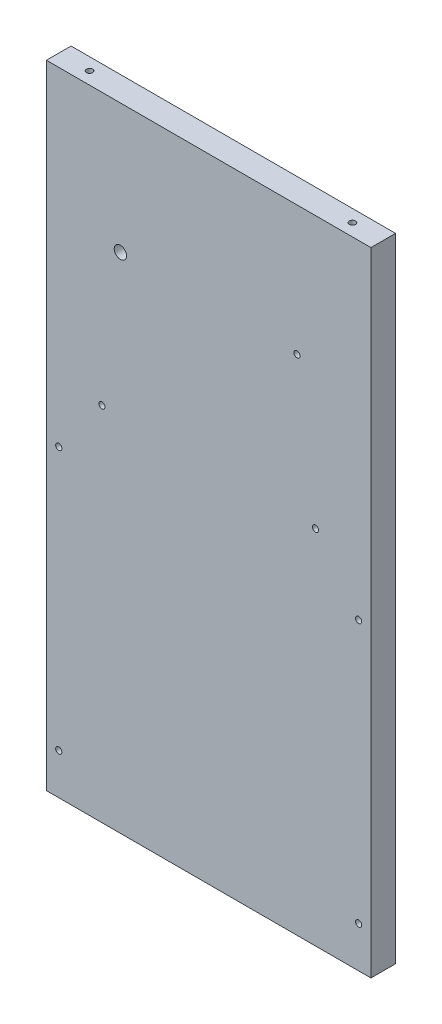
ISO-10303-21;
HEADER;
FILE_DESCRIPTION(('STEP AP214'),'2;1');
FILE_NAME('part.step','',(''),(''),'','','');
FILE_SCHEMA(('AUTOMOTIVE_DESIGN { 1 0 10303 214 1 1 1 1 }'));
ENDSEC;
DATA;
#1=APPLICATION_CONTEXT('core data for automotive mechanical design processes');
#2=APPLICATION_PROTOCOL_DEFINITION('international standard','automotive_design',2000,#1);
#3=PRODUCT_CONTEXT('',#1,'mechanical');
#4=PRODUCT('Part','Part','',(#3));
#5=PRODUCT_RELATED_PRODUCT_CATEGORY('part','',(#4));
#6=PRODUCT_DEFINITION_FORMATION('','',#4);
#7=PRODUCT_DEFINITION_CONTEXT('part definition',#1,'design');
#8=PRODUCT_DEFINITION('design','',#6,#7);
#9=PRODUCT_DEFINITION_SHAPE('','',#8);
#10=(LENGTH_UNIT() NAMED_UNIT(*) SI_UNIT(.MILLI.,.METRE.));
#11=(NAMED_UNIT(*) PLANE_ANGLE_UNIT() SI_UNIT($,.RADIAN.));
#12=(NAMED_UNIT(*) SI_UNIT($,.STERADIAN.) SOLID_ANGLE_UNIT());
#13=UNCERTAINTY_MEASURE_WITH_UNIT(LENGTH_MEASURE(1.E-05),#10,'distance_accuracy_value','');
#14=(GEOMETRIC_REPRESENTATION_CONTEXT(3) GLOBAL_UNCERTAINTY_ASSIGNED_CONTEXT((#13)) GLOBAL_UNIT_ASSIGNED_CONTEXT((#10,
#11,#12)) REPRESENTATION_CONTEXT('',''));
#15=CARTESIAN_POINT('',(0.,0.,0.));
#16=DIRECTION('',(0.,0.,1.));
#17=DIRECTION('',(1.,0.,0.));
#18=AXIS2_PLACEMENT_3D('',#15,#16,#17);
#19=CARTESIAN_POINT('',(-129.951219512195,-28.4634146341464,12.));
#20=DIRECTION('',(0.,0.,-1.));
#21=DIRECTION('',(-1.,0.,0.));
#22=AXIS2_PLACEMENT_3D('',#19,#20,#21);
#23=CYLINDRICAL_SURFACE('',#22,1.5);
#24=CARTESIAN_POINT('',(-129.951219512195,-28.4634146341464,12.));
#25=DIRECTION('',(0.,0.,1.));
#26=DIRECTION('',(1.,0.,0.));
#27=AXIS2_PLACEMENT_3D('',#24,#25,#26);
#28=CIRCLE('',#27,1.5);
#29=CARTESIAN_POINT('',(-128.451219512195,-28.4634146341464,12.));
#30=VERTEX_POINT('',#29);
#31=EDGE_CURVE('E104',#30,#30,#28,.T.);
#32=ORIENTED_EDGE('',*,*,#31,.T.);
#33=EDGE_LOOP('',(#32));
#34=FACE_BOUND('',#33,.T.);
#35=CARTESIAN_POINT('',(-129.951219512195,-28.4634146341464,1.49999999999999));
#36=DIRECTION('',(0.,0.,-1.));
#37=DIRECTION('',(-1.,0.,0.));
#38=AXIS2_PLACEMENT_3D('',#35,#36,#37);
#39=CIRCLE('',#38,1.5);
#40=CARTESIAN_POINT('',(-131.451219512195,-28.4634146341464,1.49999999999999));
#41=VERTEX_POINT('',#40);
#42=EDGE_CURVE('E37',#41,#41,#39,.T.);
#43=ORIENTED_EDGE('',*,*,#42,.T.);
#44=EDGE_LOOP('',(#43));
#45=FACE_BOUND('',#44,.T.);
#46=ADVANCED_FACE('F33',(#34,#45),#23,.F.);
#47=CARTESIAN_POINT('',(-34.951219512195,40.5365853658536,12.));
#48=DIRECTION('',(0.,0.,-1.));
#49=DIRECTION('',(-1.,0.,0.));
#50=AXIS2_PLACEMENT_3D('',#47,#48,#49);
#51=CYLINDRICAL_SURFACE('',#50,1.5);
#52=CARTESIAN_POINT('',(-34.951219512195,40.5365853658536,12.));
#53=DIRECTION('',(0.,0.,1.));
#54=DIRECTION('',(1.,0.,0.));
#55=AXIS2_PLACEMENT_3D('',#52,#53,#54);
#56=CIRCLE('',#55,1.5);
#57=CARTESIAN_POINT('',(-33.451219512195,40.5365853658536,12.));
#58=VERTEX_POINT('',#57);
#59=EDGE_CURVE('E159',#58,#58,#56,.T.);
#60=ORIENTED_EDGE('',*,*,#59,.T.);
#61=EDGE_LOOP('',(#60));
#62=FACE_BOUND('',#61,.T.);
#63=CARTESIAN_POINT('',(-34.951219512195,40.5365853658536,1.5));
#64=DIRECTION('',(0.,0.,-1.));
#65=DIRECTION('',(-1.,0.,0.));
#66=AXIS2_PLACEMENT_3D('',#63,#64,#65);
#67=CIRCLE('',#66,1.5);
#68=CARTESIAN_POINT('',(-36.451219512195,40.5365853658536,1.5));
#69=VERTEX_POINT('',#68);
#70=EDGE_CURVE('E127',#69,#69,#67,.T.);
#71=ORIENTED_EDGE('',*,*,#70,.T.);
#72=EDGE_LOOP('',(#71));
#73=FACE_BOUND('',#72,.T.);
#74=ADVANCED_FACE('F187',(#62,#73),#51,.F.);
#75=CARTESIAN_POINT('',(-4.95121951219504,-184.463414634146,12.));
#76=DIRECTION('',(0.,0.,-1.));
#77=DIRECTION('',(-1.,0.,0.));
#78=AXIS2_PLACEMENT_3D('',#75,#76,#77);
#79=CYLINDRICAL_SURFACE('',#78,1.5);
#80=CARTESIAN_POINT('',(-4.95121951219504,-184.463414634146,12.));
#81=DIRECTION('',(0.,0.,1.));
#82=DIRECTION('',(1.,0.,0.));
#83=AXIS2_PLACEMENT_3D('',#80,#81,#82);
#84=CIRCLE('',#83,1.5);
#85=CARTESIAN_POINT('',(-3.45121951219504,-184.463414634146,12.));
#86=VERTEX_POINT('',#85);
#87=EDGE_CURVE('E156',#86,#86,#84,.T.);
#88=ORIENTED_EDGE('',*,*,#87,.T.);
#89=EDGE_LOOP('',(#88));
#90=FACE_BOUND('',#89,.T.);
#91=CARTESIAN_POINT('',(-4.95121951219504,-184.463414634146,1.49999999999999));
#92=DIRECTION('',(0.,0.,-1.));
#93=DIRECTION('',(-1.,0.,0.));
#94=AXIS2_PLACEMENT_3D('',#91,#92,#93);
#95=CIRCLE('',#94,1.5);
#96=CARTESIAN_POINT('',(-6.45121951219504,-184.463414634146,1.49999999999999));
#97=VERTEX_POINT('',#96);
#98=EDGE_CURVE('E125',#97,#97,#95,.T.);
#99=ORIENTED_EDGE('',*,*,#98,.T.);
#100=EDGE_LOOP('',(#99));
#101=FACE_BOUND('',#100,.T.);
#102=ADVANCED_FACE('F191',(#90,#101),#79,.F.);
#103=CARTESIAN_POINT('',(-4.95121951219506,-56.4634146341464,12.));
#104=DIRECTION('',(0.,0.,-1.));
#105=DIRECTION('',(-1.,0.,0.));
#106=AXIS2_PLACEMENT_3D('',#103,#104,#105);
#107=CYLINDRICAL_SURFACE('',#106,1.5);
#108=CARTESIAN_POINT('',(-4.95121951219506,-56.4634146341464,12.));
#109=DIRECTION('',(0.,0.,1.));
#110=DIRECTION('',(1.,0.,0.));
#111=AXIS2_PLACEMENT_3D('',#108,#109,#110);
#112=CIRCLE('',#111,1.5);
#113=CARTESIAN_POINT('',(-3.45121951219505,-56.4634146341464,12.));
#114=VERTEX_POINT('',#113);
#115=EDGE_CURVE('E153',#114,#114,#112,.T.);
#116=ORIENTED_EDGE('',*,*,#115,.T.);
#117=EDGE_LOOP('',(#116));
#118=FACE_BOUND('',#117,.T.);
#119=CARTESIAN_POINT('',(-4.95121951219506,-56.4634146341464,1.5));
#120=DIRECTION('',(0.,0.,-1.));
#121=DIRECTION('',(-1.,0.,0.));
#122=AXIS2_PLACEMENT_3D('',#119,#120,#121);
#123=CIRCLE('',#122,1.5);
#124=CARTESIAN_POINT('',(-6.45121951219506,-56.4634146341464,1.5));
#125=VERTEX_POINT('',#124);
#126=EDGE_CURVE('E122',#125,#125,#123,.T.);
#127=ORIENTED_EDGE('',*,*,#126,.T.);
#128=EDGE_LOOP('',(#127));
#129=FACE_BOUND('',#128,.T.);
#130=ADVANCED_FACE('F197',(#118,#129),#107,.F.);
#131=CARTESIAN_POINT('',(-150.951219512195,-184.463414634146,12.));
#132=DIRECTION('',(0.,0.,-1.));
#133=DIRECTION('',(-1.,0.,0.));
#134=AXIS2_PLACEMENT_3D('',#131,#132,#133);
#135=CYLINDRICAL_SURFACE('',#134,1.5);
#136=CARTESIAN_POINT('',(-150.951219512195,-184.463414634146,12.));
#137=DIRECTION('',(0.,0.,1.));
#138=DIRECTION('',(1.,0.,0.));
#139=AXIS2_PLACEMENT_3D('',#136,#137,#138);
#140=CIRCLE('',#139,1.5);
#141=CARTESIAN_POINT('',(-149.451219512195,-184.463414634146,12.));
#142=VERTEX_POINT('',#141);
#143=EDGE_CURVE('E150',#142,#142,#140,.T.);
#144=ORIENTED_EDGE('',*,*,#143,.T.);
#145=EDGE_LOOP('',(#144));
#146=FACE_BOUND('',#145,.T.);
#147=CARTESIAN_POINT('',(-150.951219512195,-184.463414634146,1.49999999999999));
#148=DIRECTION('',(0.,0.,-1.));
#149=DIRECTION('',(-1.,0.,0.));
#150=AXIS2_PLACEMENT_3D('',#147,#148,#149);
#151=CIRCLE('',#150,1.5);
#152=CARTESIAN_POINT('',(-152.451219512195,-184.463414634146,1.49999999999999));
#153=VERTEX_POINT('',#152);
#154=EDGE_CURVE('E118',#153,#153,#151,.T.);
#155=ORIENTED_EDGE('',*,*,#154,.T.);
#156=EDGE_LOOP('',(#155));
#157=FACE_BOUND('',#156,.T.);
#158=ADVANCED_FACE('F201',(#146,#157),#135,.F.);
#159=CARTESIAN_POINT('',(-150.951219512195,-56.4634146341464,12.));
#160=DIRECTION('',(0.,0.,-1.));
#161=DIRECTION('',(-1.,0.,0.));
#162=AXIS2_PLACEMENT_3D('',#159,#160,#161);
#163=CYLINDRICAL_SURFACE('',#162,1.5);
#164=CARTESIAN_POINT('',(-150.951219512195,-56.4634146341464,12.));
#165=DIRECTION('',(0.,0.,1.));
#166=DIRECTION('',(1.,0.,0.));
#167=AXIS2_PLACEMENT_3D('',#164,#165,#166);
#168=CIRCLE('',#167,1.5);
#169=CARTESIAN_POINT('',(-149.451219512195,-56.4634146341464,12.));
#170=VERTEX_POINT('',#169);
#171=EDGE_CURVE('E145',#170,#170,#168,.T.);
#172=ORIENTED_EDGE('',*,*,#171,.T.);
#173=EDGE_LOOP('',(#172));
#174=FACE_BOUND('',#173,.T.);
#175=CARTESIAN_POINT('',(-150.951219512195,-56.4634146341464,1.49999999999999));
#176=DIRECTION('',(0.,0.,-1.));
#177=DIRECTION('',(-1.,0.,0.));
#178=AXIS2_PLACEMENT_3D('',#175,#176,#177);
#179=CIRCLE('',#178,1.5);
#180=CARTESIAN_POINT('',(-152.451219512195,-56.4634146341464,1.49999999999999));
#181=VERTEX_POINT('',#180);
#182=EDGE_CURVE('E115',#181,#181,#179,.T.);
#183=ORIENTED_EDGE('',*,*,#182,.T.);
#184=EDGE_LOOP('',(#183));
#185=FACE_BOUND('',#184,.T.);
#186=ADVANCED_FACE('F180',(#174,#185),#163,.F.);
#187=CARTESIAN_POINT('',(-25.9512195121951,-28.4634146341464,12.));
#188=DIRECTION('',(0.,0.,-1.));
#189=DIRECTION('',(-1.,0.,0.));
#190=AXIS2_PLACEMENT_3D('',#187,#188,#189);
#191=CYLINDRICAL_SURFACE('',#190,1.5);
#192=CARTESIAN_POINT('',(-25.9512195121951,-28.4634146341464,12.));
#193=DIRECTION('',(0.,0.,1.));
#194=DIRECTION('',(1.,0.,0.));
#195=AXIS2_PLACEMENT_3D('',#192,#193,#194);
#196=CIRCLE('',#195,1.5);
#197=CARTESIAN_POINT('',(-24.4512195121951,-28.4634146341464,12.));
#198=VERTEX_POINT('',#197);
#199=EDGE_CURVE('E162',#198,#198,#196,.T.);
#200=ORIENTED_EDGE('',*,*,#199,.T.);
#201=EDGE_LOOP('',(#200));
#202=FACE_BOUND('',#201,.T.);
#203=CARTESIAN_POINT('',(-25.9512195121951,-28.4634146341464,1.5));
#204=DIRECTION('',(0.,0.,-1.));
#205=DIRECTION('',(-1.,0.,0.));
#206=AXIS2_PLACEMENT_3D('',#203,#204,#205);
#207=CIRCLE('',#206,1.5);
#208=CARTESIAN_POINT('',(-27.4512195121951,-28.4634146341464,1.5));
#209=VERTEX_POINT('',#208);
#210=EDGE_CURVE('E110',#209,#209,#207,.T.);
#211=ORIENTED_EDGE('',*,*,#210,.T.);
#212=EDGE_LOOP('',(#211));
#213=FACE_BOUND('',#212,.T.);
#214=ADVANCED_FACE('F171',(#202,#213),#191,.F.);
#215=CARTESIAN_POINT('',(0.,0.,12.));
#216=DIRECTION('',(0.,0.,1.));
#217=DIRECTION('',(1.,0.,0.));
#218=AXIS2_PLACEMENT_3D('',#215,#216,#217);
#219=PLANE('',#218);
#220=ORIENTED_EDGE('',*,*,#171,.F.);
#221=EDGE_LOOP('',(#220));
#222=FACE_BOUND('',#221,.T.);
#223=ORIENTED_EDGE('',*,*,#115,.F.);
#224=EDGE_LOOP('',(#223));
#225=FACE_BOUND('',#224,.T.);
#226=ORIENTED_EDGE('',*,*,#59,.F.);
#227=EDGE_LOOP('',(#226));
#228=FACE_BOUND('',#227,.T.);
#229=ORIENTED_EDGE('',*,*,#31,.F.);
#230=EDGE_LOOP('',(#229));
#231=FACE_BOUND('',#230,.T.);
#232=DIRECTION('',(0.,-1.,0.));
#233=VECTOR('',#232,1.);
#234=CARTESIAN_POINT('',(-156.951219512195,103.536585365854,12.));
#235=LINE('',#234,#233);
#236=CARTESIAN_POINT('',(-156.951219512195,103.536585365854,12.));
#237=VERTEX_POINT('',#236);
#238=CARTESIAN_POINT('',(-156.951219512195,-204.463414634146,12.));
#239=VERTEX_POINT('',#238);
#240=EDGE_CURVE('E88',#237,#239,#235,.T.);
#241=ORIENTED_EDGE('',*,*,#240,.T.);
#242=DIRECTION('',(1.,0.,0.));
#243=VECTOR('',#242,1.);
#244=CARTESIAN_POINT('',(-156.951219512195,-204.463414634146,12.));
#245=LINE('',#244,#243);
#246=CARTESIAN_POINT('',(1.04878048780496,-204.463414634146,12.));
#247=VERTEX_POINT('',#246);
#248=EDGE_CURVE('E82',#239,#247,#245,.T.);
#249=ORIENTED_EDGE('',*,*,#248,.T.);
#250=DIRECTION('',(0.,1.,0.));
#251=VECTOR('',#250,1.);
#252=CARTESIAN_POINT('',(1.04878048780493,103.536585365854,12.));
#253=LINE('',#252,#251);
#254=CARTESIAN_POINT('',(1.04878048780493,103.536585365854,12.));
#255=VERTEX_POINT('',#254);
#256=EDGE_CURVE('E86',#247,#255,#253,.T.);
#257=ORIENTED_EDGE('',*,*,#256,.T.);
#258=DIRECTION('',(-1.,0.,0.));
#259=VECTOR('',#258,1.);
#260=CARTESIAN_POINT('',(-156.951219512195,103.536585365854,12.));
#261=LINE('',#260,#259);
#262=EDGE_CURVE('E52',#255,#237,#261,.T.);
#263=ORIENTED_EDGE('',*,*,#262,.T.);
#264=EDGE_LOOP('',(#241,#249,#257,#263));
#265=FACE_BOUND('',#264,.T.);
#266=ORIENTED_EDGE('',*,*,#199,.F.);
#267=EDGE_LOOP('',(#266));
#268=FACE_BOUND('',#267,.T.);
#269=ORIENTED_EDGE('',*,*,#87,.F.);
#270=EDGE_LOOP('',(#269));
#271=FACE_BOUND('',#270,.T.);
#272=ORIENTED_EDGE('',*,*,#143,.F.);
#273=EDGE_LOOP('',(#272));
#274=FACE_BOUND('',#273,.T.);
#275=CARTESIAN_POINT('',(-120.951219512195,40.5365853658536,12.));
#276=DIRECTION('',(0.,0.,1.));
#277=DIRECTION('',(1.,0.,0.));
#278=AXIS2_PLACEMENT_3D('',#275,#276,#277);
#279=CIRCLE('',#278,2.99999999999999);
#280=CARTESIAN_POINT('',(-117.951219512195,40.5365853658536,12.));
#281=VERTEX_POINT('',#280);
#282=EDGE_CURVE('E142',#281,#281,#279,.T.);
#283=ORIENTED_EDGE('',*,*,#282,.F.);
#284=EDGE_LOOP('',(#283));
#285=FACE_BOUND('',#284,.T.);
#286=ADVANCED_FACE('F83',(#222,#225,#228,#231,#265,#268,#271,#274,#285),#219,.T.);
#287=CARTESIAN_POINT('',(0.,0.,0.));
#288=DIRECTION('',(0.,0.,1.));
#289=DIRECTION('',(1.,0.,0.));
#290=AXIS2_PLACEMENT_3D('',#287,#288,#289);
#291=PLANE('',#290);
#292=CARTESIAN_POINT('',(-150.951219512195,-184.463414634146,0.));
#293=DIRECTION('',(0.,0.,1.));
#294=DIRECTION('',(1.,0.,0.));
#295=AXIS2_PLACEMENT_3D('',#292,#293,#294);
#296=CIRCLE('',#295,2.99999999999999);
#297=CARTESIAN_POINT('',(-147.951219512195,-184.463414634146,0.));
#298=VERTEX_POINT('',#297);
#299=EDGE_CURVE('E272',#298,#298,#296,.T.);
#300=ORIENTED_EDGE('',*,*,#299,.T.);
#301=EDGE_LOOP('',(#300));
#302=FACE_BOUND('',#301,.T.);
#303=CARTESIAN_POINT('',(-150.951219512195,-56.4634146341464,0.));
#304=DIRECTION('',(0.,0.,1.));
#305=DIRECTION('',(1.,0.,0.));
#306=AXIS2_PLACEMENT_3D('',#303,#304,#305);
#307=CIRCLE('',#306,2.99999999999999);
#308=CARTESIAN_POINT('',(-147.951219512195,-56.4634146341464,0.));
#309=VERTEX_POINT('',#308);
#310=EDGE_CURVE('E277',#309,#309,#307,.T.);
#311=ORIENTED_EDGE('',*,*,#310,.T.);
#312=EDGE_LOOP('',(#311));
#313=FACE_BOUND('',#312,.T.);
#314=CARTESIAN_POINT('',(-4.95121951219504,-184.463414634146,0.));
#315=DIRECTION('',(0.,0.,1.));
#316=DIRECTION('',(1.,0.,0.));
#317=AXIS2_PLACEMENT_3D('',#314,#315,#316);
#318=CIRCLE('',#317,3.);
#319=CARTESIAN_POINT('',(-1.95121951219504,-184.463414634146,0.));
#320=VERTEX_POINT('',#319);
#321=EDGE_CURVE('E274',#320,#320,#318,.T.);
#322=ORIENTED_EDGE('',*,*,#321,.T.);
#323=EDGE_LOOP('',(#322));
#324=FACE_BOUND('',#323,.T.);
#325=CARTESIAN_POINT('',(-4.95121951219506,-56.4634146341464,0.));
#326=DIRECTION('',(0.,0.,1.));
#327=DIRECTION('',(1.,0.,0.));
#328=AXIS2_PLACEMENT_3D('',#325,#326,#327);
#329=CIRCLE('',#328,3.);
#330=CARTESIAN_POINT('',(-1.95121951219505,-56.4634146341464,0.));
#331=VERTEX_POINT('',#330);
#332=EDGE_CURVE('E140',#331,#331,#329,.T.);
#333=ORIENTED_EDGE('',*,*,#332,.T.);
#334=EDGE_LOOP('',(#333));
#335=FACE_BOUND('',#334,.T.);
#336=CARTESIAN_POINT('',(-34.951219512195,40.5365853658536,0.));
#337=DIRECTION('',(0.,0.,1.));
#338=DIRECTION('',(1.,0.,0.));
#339=AXIS2_PLACEMENT_3D('',#336,#337,#338);
#340=CIRCLE('',#339,3.);
#341=CARTESIAN_POINT('',(-31.951219512195,40.5365853658536,0.));
#342=VERTEX_POINT('',#341);
#343=EDGE_CURVE('E283',#342,#342,#340,.T.);
#344=ORIENTED_EDGE('',*,*,#343,.T.);
#345=EDGE_LOOP('',(#344));
#346=FACE_BOUND('',#345,.T.);
#347=CARTESIAN_POINT('',(-129.951219512195,-28.4634146341464,0.));
#348=DIRECTION('',(0.,0.,1.));
#349=DIRECTION('',(1.,0.,0.));
#350=AXIS2_PLACEMENT_3D('',#347,#348,#349);
#351=CIRCLE('',#350,2.99999999999999);
#352=CARTESIAN_POINT('',(-126.951219512195,-28.4634146341464,0.));
#353=VERTEX_POINT('',#352);
#354=EDGE_CURVE('E119',#353,#353,#351,.T.);
#355=ORIENTED_EDGE('',*,*,#354,.T.);
#356=EDGE_LOOP('',(#355));
#357=FACE_BOUND('',#356,.T.);
#358=CARTESIAN_POINT('',(-25.9512195121951,-28.4634146341464,0.));
#359=DIRECTION('',(0.,0.,1.));
#360=DIRECTION('',(1.,0.,0.));
#361=AXIS2_PLACEMENT_3D('',#358,#359,#360);
#362=CIRCLE('',#361,3.);
#363=CARTESIAN_POINT('',(-22.9512195121951,-28.4634146341464,0.));
#364=VERTEX_POINT('',#363);
#365=EDGE_CURVE('E114',#364,#364,#362,.T.);
#366=ORIENTED_EDGE('',*,*,#365,.T.);
#367=EDGE_LOOP('',(#366));
#368=FACE_BOUND('',#367,.T.);
#369=DIRECTION('',(0.,-1.,0.));
#370=VECTOR('',#369,1.);
#371=CARTESIAN_POINT('',(-156.951219512195,103.536585365854,0.));
#372=LINE('',#371,#370);
#373=CARTESIAN_POINT('',(-156.951219512195,103.536585365854,0.));
#374=VERTEX_POINT('',#373);
#375=CARTESIAN_POINT('',(-156.951219512195,-204.463414634146,0.));
#376=VERTEX_POINT('',#375);
#377=EDGE_CURVE('E101',#374,#376,#372,.T.);
#378=ORIENTED_EDGE('',*,*,#377,.F.);
#379=DIRECTION('',(-1.,0.,0.));
#380=VECTOR('',#379,1.);
#381=CARTESIAN_POINT('',(-156.951219512195,103.536585365854,0.));
#382=LINE('',#381,#380);
#383=CARTESIAN_POINT('',(1.04878048780493,103.536585365854,0.));
#384=VERTEX_POINT('',#383);
#385=EDGE_CURVE('E75',#384,#374,#382,.T.);
#386=ORIENTED_EDGE('',*,*,#385,.F.);
#387=DIRECTION('',(0.,1.,0.));
#388=VECTOR('',#387,1.);
#389=CARTESIAN_POINT('',(1.04878048780493,103.536585365854,0.));
#390=LINE('',#389,#388);
#391=CARTESIAN_POINT('',(1.04878048780496,-204.463414634146,0.));
#392=VERTEX_POINT('',#391);
#393=EDGE_CURVE('E69',#392,#384,#390,.T.);
#394=ORIENTED_EDGE('',*,*,#393,.F.);
#395=DIRECTION('',(1.,0.,0.));
#396=VECTOR('',#395,1.);
#397=CARTESIAN_POINT('',(-156.951219512195,-204.463414634146,0.));
#398=LINE('',#397,#396);
#399=EDGE_CURVE('E92',#376,#392,#398,.T.);
#400=ORIENTED_EDGE('',*,*,#399,.F.);
#401=EDGE_LOOP('',(#378,#386,#394,#400));
#402=FACE_BOUND('',#401,.T.);
#403=CARTESIAN_POINT('',(-120.951219512195,40.5365853658536,0.));
#404=DIRECTION('',(0.,0.,1.));
#405=DIRECTION('',(1.,0.,0.));
#406=AXIS2_PLACEMENT_3D('',#403,#404,#405);
#407=CIRCLE('',#406,2.99999999999999);
#408=CARTESIAN_POINT('',(-117.951219512195,40.5365853658536,0.));
#409=VERTEX_POINT('',#408);
#410=EDGE_CURVE('E113',#409,#409,#407,.T.);
#411=ORIENTED_EDGE('',*,*,#410,.T.);
#412=EDGE_LOOP('',(#411));
#413=FACE_BOUND('',#412,.T.);
#414=ADVANCED_FACE('F170',(#302,#313,#324,#335,#346,#357,#368,#402,#413),#291,.F.);
#415=CARTESIAN_POINT('',(-156.951219512195,103.536585365854,12.));
#416=DIRECTION('',(1.,0.,0.));
#417=DIRECTION('',(0.,1.,0.));
#418=AXIS2_PLACEMENT_3D('',#415,#416,#417);
#419=PLANE('',#418);
#420=ORIENTED_EDGE('',*,*,#377,.T.);
#421=DIRECTION('',(0.,0.,-1.));
#422=VECTOR('',#421,1.);
#423=CARTESIAN_POINT('',(-156.951219512195,-204.463414634146,12.));
#424=LINE('',#423,#422);
#425=EDGE_CURVE('E11',#239,#376,#424,.T.);
#426=ORIENTED_EDGE('',*,*,#425,.F.);
#427=ORIENTED_EDGE('',*,*,#240,.F.);
#428=DIRECTION('',(0.,0.,-1.));
#429=VECTOR('',#428,1.);
#430=CARTESIAN_POINT('',(-156.951219512195,103.536585365854,12.));
#431=LINE('',#430,#429);
#432=EDGE_CURVE('E97',#237,#374,#431,.T.);
#433=ORIENTED_EDGE('',*,*,#432,.T.);
#434=EDGE_LOOP('',(#420,#426,#427,#433));
#435=FACE_BOUND('',#434,.T.);
#436=ADVANCED_FACE('F35',(#435),#419,.F.);
#437=CARTESIAN_POINT('',(-156.951219512195,-204.463414634146,12.));
#438=DIRECTION('',(0.,1.,0.));
#439=DIRECTION('',(0.,0.,1.));
#440=AXIS2_PLACEMENT_3D('',#437,#438,#439);
#441=PLANE('',#440);
#442=ORIENTED_EDGE('',*,*,#399,.T.);
#443=DIRECTION('',(0.,0.,-1.));
#444=VECTOR('',#443,1.);
#445=CARTESIAN_POINT('',(1.04878048780496,-204.463414634146,12.));
#446=LINE('',#445,#444);
#447=EDGE_CURVE('E43',#247,#392,#446,.T.);
#448=ORIENTED_EDGE('',*,*,#447,.F.);
#449=ORIENTED_EDGE('',*,*,#248,.F.);
#450=ORIENTED_EDGE('',*,*,#425,.T.);
#451=EDGE_LOOP('',(#442,#448,#449,#450));
#452=FACE_BOUND('',#451,.T.);
#453=ADVANCED_FACE('F91',(#452),#441,.F.);
#454=CARTESIAN_POINT('',(1.04878048780493,103.536585365854,12.));
#455=DIRECTION('',(-1.,0.,0.));
#456=DIRECTION('',(0.,-1.,0.));
#457=AXIS2_PLACEMENT_3D('',#454,#455,#456);
#458=PLANE('',#457);
#459=ORIENTED_EDGE('',*,*,#393,.T.);
#460=DIRECTION('',(0.,0.,-1.));
#461=VECTOR('',#460,1.);
#462=CARTESIAN_POINT('',(1.04878048780493,103.536585365854,12.));
#463=LINE('',#462,#461);
#464=EDGE_CURVE('E93',#255,#384,#463,.T.);
#465=ORIENTED_EDGE('',*,*,#464,.F.);
#466=ORIENTED_EDGE('',*,*,#256,.F.);
#467=ORIENTED_EDGE('',*,*,#447,.T.);
#468=EDGE_LOOP('',(#459,#465,#466,#467));
#469=FACE_BOUND('',#468,.T.);
#470=ADVANCED_FACE('F95',(#469),#458,.F.);
#471=CARTESIAN_POINT('',(-156.951219512195,103.536585365854,12.));
#472=DIRECTION('',(0.,-1.,0.));
#473=DIRECTION('',(0.,0.,-1.));
#474=AXIS2_PLACEMENT_3D('',#471,#472,#473);
#475=PLANE('',#474);
#476=CARTESIAN_POINT('',(-13.9512195121951,103.536585365854,6.00000000000002));
#477=DIRECTION('',(0.,-1.,0.));
#478=DIRECTION('',(0.,0.,-1.));
#479=AXIS2_PLACEMENT_3D('',#476,#477,#478);
#480=CIRCLE('',#479,1.5);
#481=CARTESIAN_POINT('',(-13.9512195121951,103.536585365854,4.50000000000002));
#482=VERTEX_POINT('',#481);
#483=EDGE_CURVE('E263',#482,#482,#480,.T.);
#484=ORIENTED_EDGE('',*,*,#483,.T.);
#485=EDGE_LOOP('',(#484));
#486=FACE_BOUND('',#485,.T.);
#487=CARTESIAN_POINT('',(-141.951219512195,103.536585365854,6.00000000000002));
#488=DIRECTION('',(0.,-1.,0.));
#489=DIRECTION('',(0.,0.,-1.));
#490=AXIS2_PLACEMENT_3D('',#487,#488,#489);
#491=CIRCLE('',#490,1.5);
#492=CARTESIAN_POINT('',(-141.951219512195,103.536585365854,4.50000000000002));
#493=VERTEX_POINT('',#492);
#494=EDGE_CURVE('E262',#493,#493,#491,.T.);
#495=ORIENTED_EDGE('',*,*,#494,.T.);
#496=EDGE_LOOP('',(#495));
#497=FACE_BOUND('',#496,.T.);
#498=ORIENTED_EDGE('',*,*,#385,.T.);
#499=ORIENTED_EDGE('',*,*,#432,.F.);
#500=ORIENTED_EDGE('',*,*,#262,.F.);
#501=ORIENTED_EDGE('',*,*,#464,.T.);
#502=EDGE_LOOP('',(#498,#499,#500,#501));
#503=FACE_BOUND('',#502,.T.);
#504=ADVANCED_FACE('F213',(#486,#497,#503),#475,.F.);
#505=CARTESIAN_POINT('',(-120.951219512195,40.5365853658536,12.));
#506=DIRECTION('',(0.,0.,-1.));
#507=DIRECTION('',(-1.,0.,0.));
#508=AXIS2_PLACEMENT_3D('',#505,#506,#507);
#509=CYLINDRICAL_SURFACE('',#508,2.99999999999999);
#510=ORIENTED_EDGE('',*,*,#282,.T.);
#511=EDGE_LOOP('',(#510));
#512=FACE_BOUND('',#511,.T.);
#513=ORIENTED_EDGE('',*,*,#410,.F.);
#514=EDGE_LOOP('',(#513));
#515=FACE_BOUND('',#514,.T.);
#516=ADVANCED_FACE('F209',(#512,#515),#509,.F.);
#517=CARTESIAN_POINT('',(-25.9512195121951,-28.4634146341464,0.));
#518=DIRECTION('',(0.,0.,-1.));
#519=DIRECTION('',(1.,0.,0.));
#520=AXIS2_PLACEMENT_3D('',#517,#518,#519);
#521=CONICAL_SURFACE('',#520,3.,0.78539816339745);
#522=ORIENTED_EDGE('',*,*,#210,.F.);
#523=EDGE_LOOP('',(#522));
#524=FACE_BOUND('',#523,.T.);
#525=ORIENTED_EDGE('',*,*,#365,.F.);
#526=EDGE_LOOP('',(#525));
#527=FACE_BOUND('',#526,.T.);
#528=ADVANCED_FACE('F212',(#524,#527),#521,.F.);
#529=CARTESIAN_POINT('',(-150.951219512195,-56.4634146341464,0.));
#530=DIRECTION('',(0.,0.,-1.));
#531=DIRECTION('',(1.,0.,0.));
#532=AXIS2_PLACEMENT_3D('',#529,#530,#531);
#533=CONICAL_SURFACE('',#532,2.99999999999999,0.78539816339745);
#534=ORIENTED_EDGE('',*,*,#182,.F.);
#535=EDGE_LOOP('',(#534));
#536=FACE_BOUND('',#535,.T.);
#537=ORIENTED_EDGE('',*,*,#310,.F.);
#538=EDGE_LOOP('',(#537));
#539=FACE_BOUND('',#538,.T.);
#540=ADVANCED_FACE('F217',(#536,#539),#533,.F.);
#541=CARTESIAN_POINT('',(-150.951219512195,-184.463414634146,0.));
#542=DIRECTION('',(0.,0.,-1.));
#543=DIRECTION('',(1.,0.,0.));
#544=AXIS2_PLACEMENT_3D('',#541,#542,#543);
#545=CONICAL_SURFACE('',#544,2.99999999999999,0.78539816339745);
#546=ORIENTED_EDGE('',*,*,#154,.F.);
#547=EDGE_LOOP('',(#546));
#548=FACE_BOUND('',#547,.T.);
#549=ORIENTED_EDGE('',*,*,#299,.F.);
#550=EDGE_LOOP('',(#549));
#551=FACE_BOUND('',#550,.T.);
#552=ADVANCED_FACE('F223',(#548,#551),#545,.F.);
#553=CARTESIAN_POINT('',(-4.95121951219506,-56.4634146341464,0.));
#554=DIRECTION('',(0.,0.,-1.));
#555=DIRECTION('',(1.,0.,0.));
#556=AXIS2_PLACEMENT_3D('',#553,#554,#555);
#557=CONICAL_SURFACE('',#556,3.,0.78539816339745);
#558=ORIENTED_EDGE('',*,*,#126,.F.);
#559=EDGE_LOOP('',(#558));
#560=FACE_BOUND('',#559,.T.);
#561=ORIENTED_EDGE('',*,*,#332,.F.);
#562=EDGE_LOOP('',(#561));
#563=FACE_BOUND('',#562,.T.);
#564=ADVANCED_FACE('F219',(#560,#563),#557,.F.);
#565=CARTESIAN_POINT('',(-4.95121951219504,-184.463414634146,0.));
#566=DIRECTION('',(0.,0.,-1.));
#567=DIRECTION('',(1.,0.,0.));
#568=AXIS2_PLACEMENT_3D('',#565,#566,#567);
#569=CONICAL_SURFACE('',#568,3.,0.78539816339745);
#570=ORIENTED_EDGE('',*,*,#98,.F.);
#571=EDGE_LOOP('',(#570));
#572=FACE_BOUND('',#571,.T.);
#573=ORIENTED_EDGE('',*,*,#321,.F.);
#574=EDGE_LOOP('',(#573));
#575=FACE_BOUND('',#574,.T.);
#576=ADVANCED_FACE('F222',(#572,#575),#569,.F.);
#577=CARTESIAN_POINT('',(-34.951219512195,40.5365853658536,0.));
#578=DIRECTION('',(0.,0.,-1.));
#579=DIRECTION('',(1.,0.,0.));
#580=AXIS2_PLACEMENT_3D('',#577,#578,#579);
#581=CONICAL_SURFACE('',#580,3.,0.78539816339745);
#582=ORIENTED_EDGE('',*,*,#70,.F.);
#583=EDGE_LOOP('',(#582));
#584=FACE_BOUND('',#583,.T.);
#585=ORIENTED_EDGE('',*,*,#343,.F.);
#586=EDGE_LOOP('',(#585));
#587=FACE_BOUND('',#586,.T.);
#588=ADVANCED_FACE('F225',(#584,#587),#581,.F.);
#589=CARTESIAN_POINT('',(-129.951219512195,-28.4634146341464,0.));
#590=DIRECTION('',(0.,0.,-1.));
#591=DIRECTION('',(1.,0.,0.));
#592=AXIS2_PLACEMENT_3D('',#589,#590,#591);
#593=CONICAL_SURFACE('',#592,2.99999999999999,0.78539816339745);
#594=ORIENTED_EDGE('',*,*,#42,.F.);
#595=EDGE_LOOP('',(#594));
#596=FACE_BOUND('',#595,.T.);
#597=ORIENTED_EDGE('',*,*,#354,.F.);
#598=EDGE_LOOP('',(#597));
#599=FACE_BOUND('',#598,.T.);
#600=ADVANCED_FACE('F228',(#596,#599),#593,.F.);
#601=CARTESIAN_POINT('',(-141.951219512195,83.5365853658536,6.00000000000002));
#602=DIRECTION('',(0.,1.,0.));
#603=DIRECTION('',(0.,0.,1.));
#604=AXIS2_PLACEMENT_3D('',#601,#602,#603);
#605=CYLINDRICAL_SURFACE('',#604,1.5);
#606=CARTESIAN_POINT('',(-141.951219512195,83.5365853658536,6.00000000000002));
#607=DIRECTION('',(0.,-1.,0.));
#608=DIRECTION('',(0.,0.,-1.));
#609=AXIS2_PLACEMENT_3D('',#606,#607,#608);
#610=CIRCLE('',#609,1.5);
#611=CARTESIAN_POINT('',(-141.951219512195,83.5365853658536,4.50000000000002));
#612=VERTEX_POINT('',#611);
#613=EDGE_CURVE('E266',#612,#612,#610,.T.);
#614=ORIENTED_EDGE('',*,*,#613,.T.);
#615=EDGE_LOOP('',(#614));
#616=FACE_BOUND('',#615,.T.);
#617=ORIENTED_EDGE('',*,*,#494,.F.);
#618=EDGE_LOOP('',(#617));
#619=FACE_BOUND('',#618,.T.);
#620=ADVANCED_FACE('F232',(#616,#619),#605,.F.);
#621=CARTESIAN_POINT('',(-141.951219512195,83.5365853658536,6.00000000000002));
#622=DIRECTION('',(0.,-1.,0.));
#623=DIRECTION('',(0.,0.,-1.));
#624=AXIS2_PLACEMENT_3D('',#621,#622,#623);
#625=PLANE('',#624);
#626=ORIENTED_EDGE('',*,*,#613,.F.);
#627=EDGE_LOOP('',(#626));
#628=FACE_BOUND('',#627,.T.);
#629=ADVANCED_FACE('F245',(#628),#625,.F.);
#630=CARTESIAN_POINT('',(-13.9512195121951,83.5365853658536,6.00000000000002));
#631=DIRECTION('',(0.,1.,0.));
#632=DIRECTION('',(0.,0.,1.));
#633=AXIS2_PLACEMENT_3D('',#630,#631,#632);
#634=CYLINDRICAL_SURFACE('',#633,1.5);
#635=CARTESIAN_POINT('',(-13.9512195121951,83.5365853658536,6.00000000000002));
#636=DIRECTION('',(0.,-1.,0.));
#637=DIRECTION('',(0.,0.,-1.));
#638=AXIS2_PLACEMENT_3D('',#635,#636,#637);
#639=CIRCLE('',#638,1.5);
#640=CARTESIAN_POINT('',(-13.9512195121951,83.5365853658536,4.50000000000002));
#641=VERTEX_POINT('',#640);
#642=EDGE_CURVE('E261',#641,#641,#639,.T.);
#643=ORIENTED_EDGE('',*,*,#642,.T.);
#644=EDGE_LOOP('',(#643));
#645=FACE_BOUND('',#644,.T.);
#646=ORIENTED_EDGE('',*,*,#483,.F.);
#647=EDGE_LOOP('',(#646));
#648=FACE_BOUND('',#647,.T.);
#649=ADVANCED_FACE('F249',(#645,#648),#634,.F.);
#650=CARTESIAN_POINT('',(-13.9512195121951,83.5365853658536,6.00000000000002));
#651=DIRECTION('',(0.,-1.,0.));
#652=DIRECTION('',(0.,0.,-1.));
#653=AXIS2_PLACEMENT_3D('',#650,#651,#652);
#654=PLANE('',#653);
#655=ORIENTED_EDGE('',*,*,#642,.F.);
#656=EDGE_LOOP('',(#655));
#657=FACE_BOUND('',#656,.T.);
#658=ADVANCED_FACE('F253',(#657),#654,.F.);
#659=CLOSED_SHELL('',(#46,#74,#102,#130,#158,#186,#214,#286,#414,#436,#453,#470,#504,#516,#528,
#540,#552,#564,#576,#588,#600,#620,#629,#649,#658));
#660=MANIFOLD_SOLID_BREP('B2',#659);
#661=ADVANCED_BREP_SHAPE_REPRESENTATION('',(#18,#660),#14);
#662=SHAPE_DEFINITION_REPRESENTATION(#9,#661);
ENDSEC;
END-ISO-10303-21;
